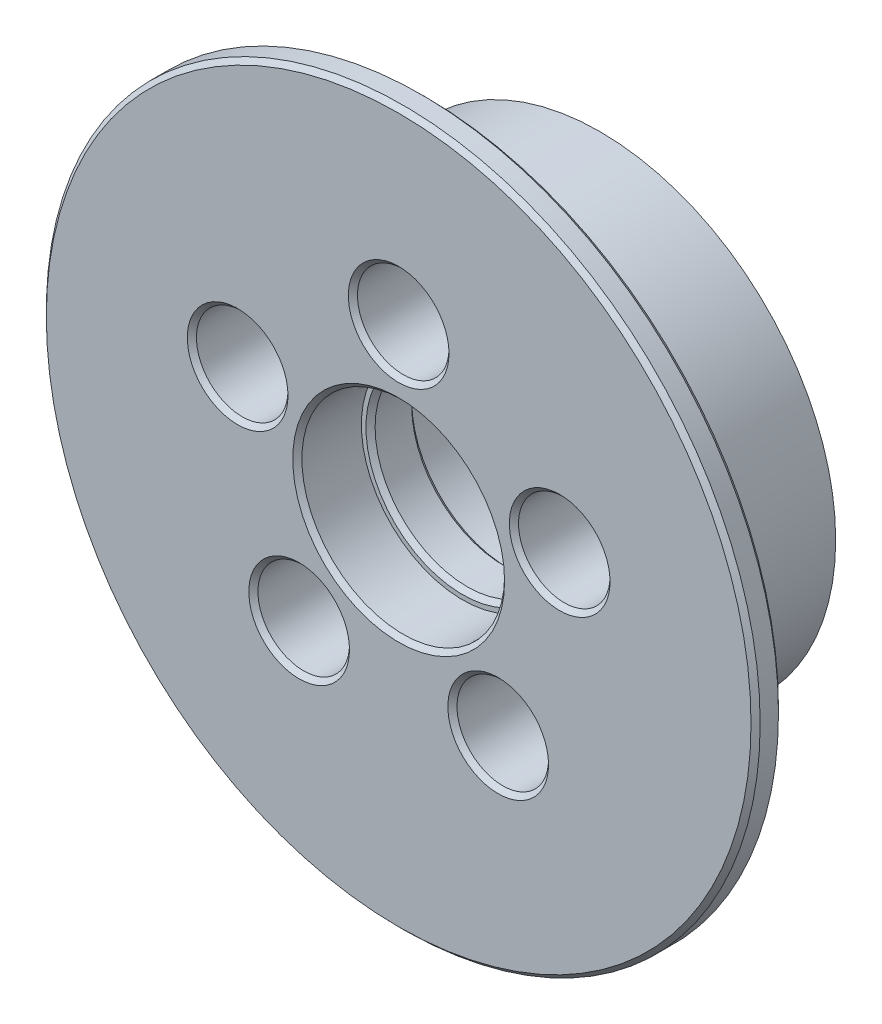
ISO-10303-21;
HEADER;
FILE_DESCRIPTION(('STEP AP214'),'2;1');
FILE_NAME('part.step','',(''),(''),'','','');
FILE_SCHEMA(('AUTOMOTIVE_DESIGN { 1 0 10303 214 1 1 1 1 }'));
ENDSEC;
DATA;
#1=APPLICATION_CONTEXT('core data for automotive mechanical design processes');
#2=APPLICATION_PROTOCOL_DEFINITION('international standard','automotive_design',2000,#1);
#3=PRODUCT_CONTEXT('',#1,'mechanical');
#4=PRODUCT('Part','Part','',(#3));
#5=PRODUCT_RELATED_PRODUCT_CATEGORY('part','',(#4));
#6=PRODUCT_DEFINITION_FORMATION('','',#4);
#7=PRODUCT_DEFINITION_CONTEXT('part definition',#1,'design');
#8=PRODUCT_DEFINITION('design','',#6,#7);
#9=PRODUCT_DEFINITION_SHAPE('','',#8);
#10=(LENGTH_UNIT() NAMED_UNIT(*) SI_UNIT(.MILLI.,.METRE.));
#11=(NAMED_UNIT(*) PLANE_ANGLE_UNIT() SI_UNIT($,.RADIAN.));
#12=(NAMED_UNIT(*) SI_UNIT($,.STERADIAN.) SOLID_ANGLE_UNIT());
#13=UNCERTAINTY_MEASURE_WITH_UNIT(LENGTH_MEASURE(1.E-05),#10,'distance_accuracy_value','');
#14=(GEOMETRIC_REPRESENTATION_CONTEXT(3) GLOBAL_UNCERTAINTY_ASSIGNED_CONTEXT((#13)) GLOBAL_UNIT_ASSIGNED_CONTEXT((#10,
#11,#12)) REPRESENTATION_CONTEXT('',''));
#15=CARTESIAN_POINT('',(0.,0.,0.));
#16=DIRECTION('',(0.,0.,1.));
#17=DIRECTION('',(1.,0.,0.));
#18=AXIS2_PLACEMENT_3D('',#15,#16,#17);
#19=CARTESIAN_POINT('',(0.,0.,22.));
#20=DIRECTION('',(0.,0.,-1.));
#21=DIRECTION('',(-1.,0.,0.));
#22=AXIS2_PLACEMENT_3D('',#19,#20,#21);
#23=CYLINDRICAL_SURFACE('',#22,10.075);
#24=CARTESIAN_POINT('',(0.,0.,10.5));
#25=DIRECTION('',(0.,0.,-1.));
#26=DIRECTION('',(-1.,0.,0.));
#27=AXIS2_PLACEMENT_3D('',#24,#25,#26);
#28=CIRCLE('',#27,10.075);
#29=CARTESIAN_POINT('',(-10.075,0.,10.5));
#30=VERTEX_POINT('',#29);
#31=EDGE_CURVE('E115',#30,#30,#28,.T.);
#32=ORIENTED_EDGE('',*,*,#31,.T.);
#33=EDGE_LOOP('',(#32));
#34=FACE_BOUND('',#33,.T.);
#35=CARTESIAN_POINT('',(0.,0.,14.5));
#36=DIRECTION('',(0.,0.,1.));
#37=DIRECTION('',(1.,0.,0.));
#38=AXIS2_PLACEMENT_3D('',#35,#36,#37);
#39=CIRCLE('',#38,10.075);
#40=CARTESIAN_POINT('',(10.075,0.,14.5));
#41=VERTEX_POINT('',#40);
#42=EDGE_CURVE('E119',#41,#41,#39,.T.);
#43=ORIENTED_EDGE('',*,*,#42,.T.);
#44=EDGE_LOOP('',(#43));
#45=FACE_BOUND('',#44,.T.);
#46=ADVANCED_FACE('F39',(#34,#45),#23,.F.);
#47=CARTESIAN_POINT('',(0.,0.,19.));
#48=DIRECTION('',(0.,0.,-1.));
#49=DIRECTION('',(-1.,0.,0.));
#50=AXIS2_PLACEMENT_3D('',#47,#48,#49);
#51=CYLINDRICAL_SURFACE('',#50,25.75);
#52=CARTESIAN_POINT('',(0.,0.,19.));
#53=DIRECTION('',(0.,0.,1.));
#54=DIRECTION('',(1.,0.,0.));
#55=AXIS2_PLACEMENT_3D('',#52,#53,#54);
#56=CIRCLE('',#55,25.75);
#57=CARTESIAN_POINT('',(25.75,0.,19.));
#58=VERTEX_POINT('',#57);
#59=EDGE_CURVE('E175',#58,#58,#56,.T.);
#60=ORIENTED_EDGE('',*,*,#59,.F.);
#61=EDGE_LOOP('',(#60));
#62=FACE_BOUND('',#61,.T.);
#63=CARTESIAN_POINT('',(0.,0.,0.));
#64=DIRECTION('',(0.,0.,1.));
#65=DIRECTION('',(1.,0.,0.));
#66=AXIS2_PLACEMENT_3D('',#63,#64,#65);
#67=CIRCLE('',#66,25.75);
#68=CARTESIAN_POINT('',(25.75,0.,0.));
#69=VERTEX_POINT('',#68);
#70=EDGE_CURVE('E176',#69,#69,#67,.T.);
#71=ORIENTED_EDGE('',*,*,#70,.T.);
#72=EDGE_LOOP('',(#71));
#73=FACE_BOUND('',#72,.T.);
#74=ADVANCED_FACE('F211',(#62,#73),#51,.T.);
#75=CARTESIAN_POINT('',(0.,0.,0.));
#76=DIRECTION('',(0.,0.,1.));
#77=DIRECTION('',(1.,0.,0.));
#78=AXIS2_PLACEMENT_3D('',#75,#76,#77);
#79=PLANE('',#78);
#80=CARTESIAN_POINT('',(0.,18.5,0.));
#81=DIRECTION('',(0.,0.,1.));
#82=DIRECTION('',(1.,0.,0.));
#83=AXIS2_PLACEMENT_3D('',#80,#81,#82);
#84=CIRCLE('',#83,6.);
#85=CARTESIAN_POINT('',(6.,18.5,0.));
#86=VERTEX_POINT('',#85);
#87=EDGE_CURVE('E63',#86,#86,#84,.T.);
#88=ORIENTED_EDGE('',*,*,#87,.T.);
#89=EDGE_LOOP('',(#88));
#90=FACE_BOUND('',#89,.T.);
#91=CARTESIAN_POINT('',(-17.5945455514603,5.71681439593653,0.));
#92=DIRECTION('',(0.,0.,1.));
#93=DIRECTION('',(1.,0.,0.));
#94=AXIS2_PLACEMENT_3D('',#91,#92,#93);
#95=CIRCLE('',#94,6.);
#96=CARTESIAN_POINT('',(-11.5945455514603,5.71681439593653,0.));
#97=VERTEX_POINT('',#96);
#98=EDGE_CURVE('E67',#97,#97,#95,.T.);
#99=ORIENTED_EDGE('',*,*,#98,.T.);
#100=EDGE_LOOP('',(#99));
#101=FACE_BOUND('',#100,.T.);
#102=CARTESIAN_POINT('',(-10.8740271674108,-14.9668143959365,0.));
#103=DIRECTION('',(0.,0.,1.));
#104=DIRECTION('',(1.,0.,0.));
#105=AXIS2_PLACEMENT_3D('',#102,#103,#104);
#106=CIRCLE('',#105,6.);
#107=CARTESIAN_POINT('',(-4.87402716741075,-14.9668143959365,0.));
#108=VERTEX_POINT('',#107);
#109=EDGE_CURVE('E71',#108,#108,#106,.T.);
#110=ORIENTED_EDGE('',*,*,#109,.T.);
#111=EDGE_LOOP('',(#110));
#112=FACE_BOUND('',#111,.T.);
#113=CARTESIAN_POINT('',(10.8740271674108,-14.9668143959365,0.));
#114=DIRECTION('',(0.,0.,1.));
#115=DIRECTION('',(1.,0.,0.));
#116=AXIS2_PLACEMENT_3D('',#113,#114,#115);
#117=CIRCLE('',#116,6.);
#118=CARTESIAN_POINT('',(16.8740271674108,-14.9668143959365,0.));
#119=VERTEX_POINT('',#118);
#120=EDGE_CURVE('E75',#119,#119,#117,.T.);
#121=ORIENTED_EDGE('',*,*,#120,.T.);
#122=EDGE_LOOP('',(#121));
#123=FACE_BOUND('',#122,.T.);
#124=CARTESIAN_POINT('',(17.5945455514603,5.71681439593652,0.));
#125=DIRECTION('',(0.,0.,1.));
#126=DIRECTION('',(1.,0.,0.));
#127=AXIS2_PLACEMENT_3D('',#124,#125,#126);
#128=CIRCLE('',#127,6.);
#129=CARTESIAN_POINT('',(23.5945455514603,5.71681439593652,0.));
#130=VERTEX_POINT('',#129);
#131=EDGE_CURVE('E79',#130,#130,#128,.T.);
#132=ORIENTED_EDGE('',*,*,#131,.T.);
#133=EDGE_LOOP('',(#132));
#134=FACE_BOUND('',#133,.T.);
#135=CARTESIAN_POINT('',(0.,0.,0.));
#136=DIRECTION('',(0.,0.,1.));
#137=DIRECTION('',(1.,0.,0.));
#138=AXIS2_PLACEMENT_3D('',#135,#136,#137);
#139=CIRCLE('',#138,11.575);
#140=CARTESIAN_POINT('',(11.575,0.,0.));
#141=VERTEX_POINT('',#140);
#142=EDGE_CURVE('E127',#141,#141,#139,.T.);
#143=ORIENTED_EDGE('',*,*,#142,.T.);
#144=EDGE_LOOP('',(#143));
#145=FACE_BOUND('',#144,.T.);
#146=ORIENTED_EDGE('',*,*,#70,.F.);
#147=EDGE_LOOP('',(#146));
#148=FACE_BOUND('',#147,.T.);
#149=ADVANCED_FACE('F217',(#90,#101,#112,#123,#134,#145,#148),#79,.F.);
#150=CARTESIAN_POINT('',(0.,0.,22.));
#151=DIRECTION('',(0.,0.,-1.));
#152=DIRECTION('',(-1.,0.,0.));
#153=AXIS2_PLACEMENT_3D('',#150,#151,#152);
#154=CYLINDRICAL_SURFACE('',#153,39.);
#155=CARTESIAN_POINT('',(0.,0.,21.5));
#156=DIRECTION('',(0.,0.,1.));
#157=DIRECTION('',(1.,0.,0.));
#158=AXIS2_PLACEMENT_3D('',#155,#156,#157);
#159=CIRCLE('',#158,39.);
#160=CARTESIAN_POINT('',(39.,0.,21.5));
#161=VERTEX_POINT('',#160);
#162=EDGE_CURVE('E139',#161,#161,#159,.F.);
#163=ORIENTED_EDGE('',*,*,#162,.T.);
#164=EDGE_LOOP('',(#163));
#165=FACE_BOUND('',#164,.T.);
#166=CARTESIAN_POINT('',(0.,0.,19.5));
#167=DIRECTION('',(0.,0.,1.));
#168=DIRECTION('',(1.,0.,0.));
#169=AXIS2_PLACEMENT_3D('',#166,#167,#168);
#170=CIRCLE('',#169,39.);
#171=CARTESIAN_POINT('',(39.,0.,19.5));
#172=VERTEX_POINT('',#171);
#173=EDGE_CURVE('E143',#172,#172,#170,.T.);
#174=ORIENTED_EDGE('',*,*,#173,.T.);
#175=EDGE_LOOP('',(#174));
#176=FACE_BOUND('',#175,.T.);
#177=ADVANCED_FACE('F246',(#165,#176),#154,.T.);
#178=CARTESIAN_POINT('',(0.,0.,22.));
#179=DIRECTION('',(0.,0.,1.));
#180=DIRECTION('',(1.,0.,0.));
#181=AXIS2_PLACEMENT_3D('',#178,#179,#180);
#182=PLANE('',#181);
#183=CARTESIAN_POINT('',(0.,0.,22.));
#184=DIRECTION('',(0.,0.,1.));
#185=DIRECTION('',(1.,0.,0.));
#186=AXIS2_PLACEMENT_3D('',#183,#184,#185);
#187=CIRCLE('',#186,38.5);
#188=CARTESIAN_POINT('',(38.5,0.,22.));
#189=VERTEX_POINT('',#188);
#190=EDGE_CURVE('E147',#189,#189,#187,.T.);
#191=ORIENTED_EDGE('',*,*,#190,.T.);
#192=EDGE_LOOP('',(#191));
#193=FACE_BOUND('',#192,.T.);
#194=CARTESIAN_POINT('',(0.,0.,22.));
#195=DIRECTION('',(0.,0.,1.));
#196=DIRECTION('',(1.,0.,0.));
#197=AXIS2_PLACEMENT_3D('',#194,#195,#196);
#198=CIRCLE('',#197,11.575);
#199=CARTESIAN_POINT('',(11.575,0.,22.));
#200=VERTEX_POINT('',#199);
#201=EDGE_CURVE('E151',#200,#200,#198,.F.);
#202=ORIENTED_EDGE('',*,*,#201,.T.);
#203=EDGE_LOOP('',(#202));
#204=FACE_BOUND('',#203,.T.);
#205=CARTESIAN_POINT('',(-10.8740271674108,-14.9668143959365,22.));
#206=DIRECTION('',(0.,0.,1.));
#207=DIRECTION('',(1.,0.,0.));
#208=AXIS2_PLACEMENT_3D('',#205,#206,#207);
#209=CIRCLE('',#208,5.50000000000001);
#210=CARTESIAN_POINT('',(-5.37402716741075,-14.9668143959365,22.));
#211=VERTEX_POINT('',#210);
#212=EDGE_CURVE('E155',#211,#211,#209,.F.);
#213=ORIENTED_EDGE('',*,*,#212,.T.);
#214=EDGE_LOOP('',(#213));
#215=FACE_BOUND('',#214,.T.);
#216=CARTESIAN_POINT('',(10.8740271674108,-14.9668143959365,22.));
#217=DIRECTION('',(0.,0.,1.));
#218=DIRECTION('',(1.,0.,0.));
#219=AXIS2_PLACEMENT_3D('',#216,#217,#218);
#220=CIRCLE('',#219,5.50000000000001);
#221=CARTESIAN_POINT('',(16.3740271674108,-14.9668143959365,22.));
#222=VERTEX_POINT('',#221);
#223=EDGE_CURVE('E159',#222,#222,#220,.F.);
#224=ORIENTED_EDGE('',*,*,#223,.T.);
#225=EDGE_LOOP('',(#224));
#226=FACE_BOUND('',#225,.T.);
#227=CARTESIAN_POINT('',(17.5945455514603,5.71681439593652,22.));
#228=DIRECTION('',(0.,0.,1.));
#229=DIRECTION('',(1.,0.,0.));
#230=AXIS2_PLACEMENT_3D('',#227,#228,#229);
#231=CIRCLE('',#230,5.50000000000001);
#232=CARTESIAN_POINT('',(23.0945455514603,5.71681439593652,22.));
#233=VERTEX_POINT('',#232);
#234=EDGE_CURVE('E163',#233,#233,#231,.F.);
#235=ORIENTED_EDGE('',*,*,#234,.T.);
#236=EDGE_LOOP('',(#235));
#237=FACE_BOUND('',#236,.T.);
#238=CARTESIAN_POINT('',(0.,18.5,22.));
#239=DIRECTION('',(0.,0.,1.));
#240=DIRECTION('',(1.,0.,0.));
#241=AXIS2_PLACEMENT_3D('',#238,#239,#240);
#242=CIRCLE('',#241,5.50000000000001);
#243=CARTESIAN_POINT('',(5.50000000000001,18.5,22.));
#244=VERTEX_POINT('',#243);
#245=EDGE_CURVE('E167',#244,#244,#242,.F.);
#246=ORIENTED_EDGE('',*,*,#245,.T.);
#247=EDGE_LOOP('',(#246));
#248=FACE_BOUND('',#247,.T.);
#249=CARTESIAN_POINT('',(-17.5945455514603,5.71681439593653,22.));
#250=DIRECTION('',(0.,0.,1.));
#251=DIRECTION('',(1.,0.,0.));
#252=AXIS2_PLACEMENT_3D('',#249,#250,#251);
#253=CIRCLE('',#252,5.50000000000001);
#254=CARTESIAN_POINT('',(-12.0945455514603,5.71681439593653,22.));
#255=VERTEX_POINT('',#254);
#256=EDGE_CURVE('E171',#255,#255,#253,.F.);
#257=ORIENTED_EDGE('',*,*,#256,.T.);
#258=EDGE_LOOP('',(#257));
#259=FACE_BOUND('',#258,.T.);
#260=ADVANCED_FACE('F243',(#193,#204,#215,#226,#237,#248,#259),#182,.T.);
#261=CARTESIAN_POINT('',(0.,0.,19.));
#262=DIRECTION('',(0.,0.,1.));
#263=DIRECTION('',(1.,0.,0.));
#264=AXIS2_PLACEMENT_3D('',#261,#262,#263);
#265=PLANE('',#264);
#266=CARTESIAN_POINT('',(0.,0.,19.));
#267=DIRECTION('',(0.,0.,1.));
#268=DIRECTION('',(1.,0.,0.));
#269=AXIS2_PLACEMENT_3D('',#266,#267,#268);
#270=CIRCLE('',#269,38.5);
#271=CARTESIAN_POINT('',(38.5,0.,19.));
#272=VERTEX_POINT('',#271);
#273=EDGE_CURVE('E135',#272,#272,#270,.F.);
#274=ORIENTED_EDGE('',*,*,#273,.T.);
#275=EDGE_LOOP('',(#274));
#276=FACE_BOUND('',#275,.T.);
#277=ORIENTED_EDGE('',*,*,#59,.T.);
#278=EDGE_LOOP('',(#277));
#279=FACE_BOUND('',#278,.T.);
#280=ADVANCED_FACE('F242',(#276,#279),#265,.F.);
#281=CARTESIAN_POINT('',(17.5945455514603,5.71681439593652,22.));
#282=DIRECTION('',(0.,0.,-1.));
#283=DIRECTION('',(-1.,0.,0.));
#284=AXIS2_PLACEMENT_3D('',#281,#282,#283);
#285=CYLINDRICAL_SURFACE('',#284,5.);
#286=CARTESIAN_POINT('',(17.5945455514603,5.71681439593652,1.));
#287=DIRECTION('',(0.,0.,1.));
#288=DIRECTION('',(1.,0.,0.));
#289=AXIS2_PLACEMENT_3D('',#286,#287,#288);
#290=CIRCLE('',#289,5.);
#291=CARTESIAN_POINT('',(22.5945455514603,5.71681439593652,1.));
#292=VERTEX_POINT('',#291);
#293=EDGE_CURVE('E10',#292,#292,#290,.F.);
#294=ORIENTED_EDGE('',*,*,#293,.T.);
#295=EDGE_LOOP('',(#294));
#296=FACE_BOUND('',#295,.T.);
#297=CARTESIAN_POINT('',(17.5945455514603,5.71681439593652,21.5));
#298=DIRECTION('',(0.,0.,1.));
#299=DIRECTION('',(1.,0.,0.));
#300=AXIS2_PLACEMENT_3D('',#297,#298,#299);
#301=CIRCLE('',#300,5.);
#302=CARTESIAN_POINT('',(22.5945455514603,5.71681439593652,21.5));
#303=VERTEX_POINT('',#302);
#304=EDGE_CURVE('E95',#303,#303,#301,.T.);
#305=ORIENTED_EDGE('',*,*,#304,.T.);
#306=EDGE_LOOP('',(#305));
#307=FACE_BOUND('',#306,.T.);
#308=ADVANCED_FACE('F239',(#296,#307),#285,.F.);
#309=CARTESIAN_POINT('',(10.8740271674108,-14.9668143959365,22.));
#310=DIRECTION('',(0.,0.,-1.));
#311=DIRECTION('',(-1.,0.,0.));
#312=AXIS2_PLACEMENT_3D('',#309,#310,#311);
#313=CYLINDRICAL_SURFACE('',#312,5.);
#314=CARTESIAN_POINT('',(10.8740271674108,-14.9668143959365,1.));
#315=DIRECTION('',(0.,0.,1.));
#316=DIRECTION('',(1.,0.,0.));
#317=AXIS2_PLACEMENT_3D('',#314,#315,#316);
#318=CIRCLE('',#317,5.);
#319=CARTESIAN_POINT('',(15.8740271674108,-14.9668143959365,1.));
#320=VERTEX_POINT('',#319);
#321=EDGE_CURVE('E47',#320,#320,#318,.F.);
#322=ORIENTED_EDGE('',*,*,#321,.T.);
#323=EDGE_LOOP('',(#322));
#324=FACE_BOUND('',#323,.T.);
#325=CARTESIAN_POINT('',(10.8740271674108,-14.9668143959365,21.5));
#326=DIRECTION('',(0.,0.,1.));
#327=DIRECTION('',(1.,0.,0.));
#328=AXIS2_PLACEMENT_3D('',#325,#326,#327);
#329=CIRCLE('',#328,5.);
#330=CARTESIAN_POINT('',(15.8740271674108,-14.9668143959365,21.5));
#331=VERTEX_POINT('',#330);
#332=EDGE_CURVE('E99',#331,#331,#329,.T.);
#333=ORIENTED_EDGE('',*,*,#332,.T.);
#334=EDGE_LOOP('',(#333));
#335=FACE_BOUND('',#334,.T.);
#336=ADVANCED_FACE('F235',(#324,#335),#313,.F.);
#337=CARTESIAN_POINT('',(-10.8740271674108,-14.9668143959365,22.));
#338=DIRECTION('',(0.,0.,-1.));
#339=DIRECTION('',(-1.,0.,0.));
#340=AXIS2_PLACEMENT_3D('',#337,#338,#339);
#341=CYLINDRICAL_SURFACE('',#340,5.);
#342=CARTESIAN_POINT('',(-10.8740271674108,-14.9668143959365,1.));
#343=DIRECTION('',(0.,0.,1.));
#344=DIRECTION('',(1.,0.,0.));
#345=AXIS2_PLACEMENT_3D('',#342,#343,#344);
#346=CIRCLE('',#345,5.);
#347=CARTESIAN_POINT('',(-5.87402716741075,-14.9668143959365,1.));
#348=VERTEX_POINT('',#347);
#349=EDGE_CURVE('E52',#348,#348,#346,.F.);
#350=ORIENTED_EDGE('',*,*,#349,.T.);
#351=EDGE_LOOP('',(#350));
#352=FACE_BOUND('',#351,.T.);
#353=CARTESIAN_POINT('',(-10.8740271674108,-14.9668143959365,21.5));
#354=DIRECTION('',(0.,0.,1.));
#355=DIRECTION('',(1.,0.,0.));
#356=AXIS2_PLACEMENT_3D('',#353,#354,#355);
#357=CIRCLE('',#356,5.);
#358=CARTESIAN_POINT('',(-5.87402716741075,-14.9668143959365,21.5));
#359=VERTEX_POINT('',#358);
#360=EDGE_CURVE('E103',#359,#359,#357,.T.);
#361=ORIENTED_EDGE('',*,*,#360,.T.);
#362=EDGE_LOOP('',(#361));
#363=FACE_BOUND('',#362,.T.);
#364=ADVANCED_FACE('F231',(#352,#363),#341,.F.);
#365=CARTESIAN_POINT('',(-17.5945455514603,5.71681439593653,22.));
#366=DIRECTION('',(0.,0.,-1.));
#367=DIRECTION('',(-1.,0.,0.));
#368=AXIS2_PLACEMENT_3D('',#365,#366,#367);
#369=CYLINDRICAL_SURFACE('',#368,5.);
#370=CARTESIAN_POINT('',(-17.5945455514603,5.71681439593653,1.));
#371=DIRECTION('',(0.,0.,1.));
#372=DIRECTION('',(1.,0.,0.));
#373=AXIS2_PLACEMENT_3D('',#370,#371,#372);
#374=CIRCLE('',#373,5.);
#375=CARTESIAN_POINT('',(-12.5945455514603,5.71681439593653,1.));
#376=VERTEX_POINT('',#375);
#377=EDGE_CURVE('E57',#376,#376,#374,.F.);
#378=ORIENTED_EDGE('',*,*,#377,.T.);
#379=EDGE_LOOP('',(#378));
#380=FACE_BOUND('',#379,.T.);
#381=CARTESIAN_POINT('',(-17.5945455514603,5.71681439593653,21.5));
#382=DIRECTION('',(0.,0.,1.));
#383=DIRECTION('',(1.,0.,0.));
#384=AXIS2_PLACEMENT_3D('',#381,#382,#383);
#385=CIRCLE('',#384,5.);
#386=CARTESIAN_POINT('',(-12.5945455514603,5.71681439593653,21.5));
#387=VERTEX_POINT('',#386);
#388=EDGE_CURVE('E87',#387,#387,#385,.T.);
#389=ORIENTED_EDGE('',*,*,#388,.T.);
#390=EDGE_LOOP('',(#389));
#391=FACE_BOUND('',#390,.T.);
#392=ADVANCED_FACE('F227',(#380,#391),#369,.F.);
#393=CARTESIAN_POINT('',(0.,18.5,22.));
#394=DIRECTION('',(0.,0.,-1.));
#395=DIRECTION('',(-1.,0.,0.));
#396=AXIS2_PLACEMENT_3D('',#393,#394,#395);
#397=CYLINDRICAL_SURFACE('',#396,5.);
#398=CARTESIAN_POINT('',(0.,18.5,1.));
#399=DIRECTION('',(0.,0.,1.));
#400=DIRECTION('',(1.,0.,0.));
#401=AXIS2_PLACEMENT_3D('',#398,#399,#400);
#402=CIRCLE('',#401,5.);
#403=CARTESIAN_POINT('',(5.,18.5,1.));
#404=VERTEX_POINT('',#403);
#405=EDGE_CURVE('E83',#404,#404,#402,.F.);
#406=ORIENTED_EDGE('',*,*,#405,.T.);
#407=EDGE_LOOP('',(#406));
#408=FACE_BOUND('',#407,.T.);
#409=CARTESIAN_POINT('',(0.,18.5,21.5));
#410=DIRECTION('',(0.,0.,1.));
#411=DIRECTION('',(1.,0.,0.));
#412=AXIS2_PLACEMENT_3D('',#409,#410,#411);
#413=CIRCLE('',#412,5.);
#414=CARTESIAN_POINT('',(5.,18.5,21.5));
#415=VERTEX_POINT('',#414);
#416=EDGE_CURVE('E91',#415,#415,#413,.T.);
#417=ORIENTED_EDGE('',*,*,#416,.T.);
#418=EDGE_LOOP('',(#417));
#419=FACE_BOUND('',#418,.T.);
#420=ADVANCED_FACE('F223',(#408,#419),#397,.F.);
#421=CARTESIAN_POINT('',(0.,0.,10.));
#422=DIRECTION('',(0.,0.,-1.));
#423=DIRECTION('',(-1.,0.,0.));
#424=AXIS2_PLACEMENT_3D('',#421,#422,#423);
#425=PLANE('',#424);
#426=CARTESIAN_POINT('',(0.,0.,10.));
#427=DIRECTION('',(0.,0.,-1.));
#428=DIRECTION('',(-1.,0.,0.));
#429=AXIS2_PLACEMENT_3D('',#426,#427,#428);
#430=CIRCLE('',#429,10.575);
#431=CARTESIAN_POINT('',(-10.575,0.,10.));
#432=VERTEX_POINT('',#431);
#433=EDGE_CURVE('E123',#432,#432,#430,.F.);
#434=ORIENTED_EDGE('',*,*,#433,.T.);
#435=EDGE_LOOP('',(#434));
#436=FACE_BOUND('',#435,.T.);
#437=CARTESIAN_POINT('',(0.,0.,10.));
#438=DIRECTION('',(0.,0.,-1.));
#439=DIRECTION('',(-1.,0.,0.));
#440=AXIS2_PLACEMENT_3D('',#437,#438,#439);
#441=CIRCLE('',#440,11.075);
#442=CARTESIAN_POINT('',(-11.075,0.,10.));
#443=VERTEX_POINT('',#442);
#444=EDGE_CURVE('E180',#443,#443,#441,.T.);
#445=ORIENTED_EDGE('',*,*,#444,.T.);
#446=EDGE_LOOP('',(#445));
#447=FACE_BOUND('',#446,.T.);
#448=ADVANCED_FACE('F226',(#436,#447),#425,.T.);
#449=CARTESIAN_POINT('',(0.,0.,10.));
#450=DIRECTION('',(0.,0.,-1.));
#451=DIRECTION('',(-1.,0.,0.));
#452=AXIS2_PLACEMENT_3D('',#449,#450,#451);
#453=CYLINDRICAL_SURFACE('',#452,11.075);
#454=CARTESIAN_POINT('',(0.,0.,0.499999999999987));
#455=DIRECTION('',(0.,0.,1.));
#456=DIRECTION('',(1.,0.,0.));
#457=AXIS2_PLACEMENT_3D('',#454,#455,#456);
#458=CIRCLE('',#457,11.075);
#459=CARTESIAN_POINT('',(11.075,0.,0.499999999999987));
#460=VERTEX_POINT('',#459);
#461=EDGE_CURVE('E131',#460,#460,#458,.F.);
#462=ORIENTED_EDGE('',*,*,#461,.T.);
#463=EDGE_LOOP('',(#462));
#464=FACE_BOUND('',#463,.T.);
#465=ORIENTED_EDGE('',*,*,#444,.F.);
#466=EDGE_LOOP('',(#465));
#467=FACE_BOUND('',#466,.T.);
#468=ADVANCED_FACE('F206',(#464,#467),#453,.F.);
#469=CARTESIAN_POINT('',(0.,0.,15.));
#470=DIRECTION('',(0.,0.,1.));
#471=DIRECTION('',(1.,0.,0.));
#472=AXIS2_PLACEMENT_3D('',#469,#470,#471);
#473=PLANE('',#472);
#474=CARTESIAN_POINT('',(0.,0.,15.));
#475=DIRECTION('',(0.,0.,1.));
#476=DIRECTION('',(1.,0.,0.));
#477=AXIS2_PLACEMENT_3D('',#474,#475,#476);
#478=CIRCLE('',#477,10.575);
#479=CARTESIAN_POINT('',(10.575,0.,15.));
#480=VERTEX_POINT('',#479);
#481=EDGE_CURVE('E111',#480,#480,#478,.F.);
#482=ORIENTED_EDGE('',*,*,#481,.T.);
#483=EDGE_LOOP('',(#482));
#484=FACE_BOUND('',#483,.T.);
#485=CARTESIAN_POINT('',(0.,0.,15.));
#486=DIRECTION('',(0.,0.,1.));
#487=DIRECTION('',(1.,0.,0.));
#488=AXIS2_PLACEMENT_3D('',#485,#486,#487);
#489=CIRCLE('',#488,11.075);
#490=CARTESIAN_POINT('',(11.075,0.,15.));
#491=VERTEX_POINT('',#490);
#492=EDGE_CURVE('E187',#491,#491,#489,.T.);
#493=ORIENTED_EDGE('',*,*,#492,.T.);
#494=EDGE_LOOP('',(#493));
#495=FACE_BOUND('',#494,.T.);
#496=ADVANCED_FACE('F192',(#484,#495),#473,.T.);
#497=CARTESIAN_POINT('',(0.,0.,15.));
#498=DIRECTION('',(0.,0.,1.));
#499=DIRECTION('',(1.,0.,0.));
#500=AXIS2_PLACEMENT_3D('',#497,#498,#499);
#501=CYLINDRICAL_SURFACE('',#500,11.075);
#502=CARTESIAN_POINT('',(0.,0.,21.5));
#503=DIRECTION('',(0.,0.,1.));
#504=DIRECTION('',(1.,0.,0.));
#505=AXIS2_PLACEMENT_3D('',#502,#503,#504);
#506=CIRCLE('',#505,11.075);
#507=CARTESIAN_POINT('',(11.075,0.,21.5));
#508=VERTEX_POINT('',#507);
#509=EDGE_CURVE('E107',#508,#508,#506,.T.);
#510=ORIENTED_EDGE('',*,*,#509,.T.);
#511=EDGE_LOOP('',(#510));
#512=FACE_BOUND('',#511,.T.);
#513=ORIENTED_EDGE('',*,*,#492,.F.);
#514=EDGE_LOOP('',(#513));
#515=FACE_BOUND('',#514,.T.);
#516=ADVANCED_FACE('F194',(#512,#515),#501,.F.);
#517=CARTESIAN_POINT('',(0.,0.,22.));
#518=DIRECTION('',(0.,0.,-1.));
#519=DIRECTION('',(-1.,0.,0.));
#520=AXIS2_PLACEMENT_3D('',#517,#518,#519);
#521=CONICAL_SURFACE('',#520,38.5,0.785398163397441);
#522=ORIENTED_EDGE('',*,*,#162,.F.);
#523=EDGE_LOOP('',(#522));
#524=FACE_BOUND('',#523,.T.);
#525=ORIENTED_EDGE('',*,*,#190,.F.);
#526=EDGE_LOOP('',(#525));
#527=FACE_BOUND('',#526,.T.);
#528=ADVANCED_FACE('F196',(#524,#527),#521,.T.);
#529=CARTESIAN_POINT('',(0.,0.,19.5));
#530=DIRECTION('',(0.,0.,1.));
#531=DIRECTION('',(1.,0.,0.));
#532=AXIS2_PLACEMENT_3D('',#529,#530,#531);
#533=CONICAL_SURFACE('',#532,39.,0.785398163397455);
#534=ORIENTED_EDGE('',*,*,#273,.F.);
#535=EDGE_LOOP('',(#534));
#536=FACE_BOUND('',#535,.T.);
#537=ORIENTED_EDGE('',*,*,#173,.F.);
#538=EDGE_LOOP('',(#537));
#539=FACE_BOUND('',#538,.T.);
#540=ADVANCED_FACE('F203',(#536,#539),#533,.T.);
#541=CARTESIAN_POINT('',(0.,0.,0.499999999999987));
#542=DIRECTION('',(0.,0.,-1.));
#543=DIRECTION('',(-1.,0.,0.));
#544=AXIS2_PLACEMENT_3D('',#541,#542,#543);
#545=CONICAL_SURFACE('',#544,11.075,0.785398163397452);
#546=ORIENTED_EDGE('',*,*,#142,.F.);
#547=EDGE_LOOP('',(#546));
#548=FACE_BOUND('',#547,.T.);
#549=ORIENTED_EDGE('',*,*,#461,.F.);
#550=EDGE_LOOP('',(#549));
#551=FACE_BOUND('',#550,.T.);
#552=ADVANCED_FACE('F259',(#548,#551),#545,.F.);
#553=CARTESIAN_POINT('',(0.,0.,10.));
#554=DIRECTION('',(0.,0.,-1.));
#555=DIRECTION('',(-1.,0.,0.));
#556=AXIS2_PLACEMENT_3D('',#553,#554,#555);
#557=CONICAL_SURFACE('',#556,10.575,0.785398163397441);
#558=ORIENTED_EDGE('',*,*,#31,.F.);
#559=EDGE_LOOP('',(#558));
#560=FACE_BOUND('',#559,.T.);
#561=ORIENTED_EDGE('',*,*,#433,.F.);
#562=EDGE_LOOP('',(#561));
#563=FACE_BOUND('',#562,.T.);
#564=ADVANCED_FACE('F263',(#560,#563),#557,.F.);
#565=CARTESIAN_POINT('',(0.,0.,15.));
#566=DIRECTION('',(0.,0.,1.));
#567=DIRECTION('',(1.,0.,0.));
#568=AXIS2_PLACEMENT_3D('',#565,#566,#567);
#569=CONICAL_SURFACE('',#568,10.575,0.785398163397441);
#570=ORIENTED_EDGE('',*,*,#42,.F.);
#571=EDGE_LOOP('',(#570));
#572=FACE_BOUND('',#571,.T.);
#573=ORIENTED_EDGE('',*,*,#481,.F.);
#574=EDGE_LOOP('',(#573));
#575=FACE_BOUND('',#574,.T.);
#576=ADVANCED_FACE('F267',(#572,#575),#569,.F.);
#577=CARTESIAN_POINT('',(0.,0.,21.5));
#578=DIRECTION('',(0.,0.,1.));
#579=DIRECTION('',(1.,0.,0.));
#580=AXIS2_PLACEMENT_3D('',#577,#578,#579);
#581=CONICAL_SURFACE('',#580,11.075,0.785398163397459);
#582=ORIENTED_EDGE('',*,*,#201,.F.);
#583=EDGE_LOOP('',(#582));
#584=FACE_BOUND('',#583,.T.);
#585=ORIENTED_EDGE('',*,*,#509,.F.);
#586=EDGE_LOOP('',(#585));
#587=FACE_BOUND('',#586,.T.);
#588=ADVANCED_FACE('F271',(#584,#587),#581,.F.);
#589=CARTESIAN_POINT('',(-10.8740271674108,-14.9668143959365,22.));
#590=DIRECTION('',(0.,0.,1.));
#591=DIRECTION('',(1.,0.,0.));
#592=AXIS2_PLACEMENT_3D('',#589,#590,#591);
#593=CONICAL_SURFACE('',#592,5.50000000000001,0.78539816339745);
#594=ORIENTED_EDGE('',*,*,#360,.F.);
#595=EDGE_LOOP('',(#594));
#596=FACE_BOUND('',#595,.T.);
#597=ORIENTED_EDGE('',*,*,#212,.F.);
#598=EDGE_LOOP('',(#597));
#599=FACE_BOUND('',#598,.T.);
#600=ADVANCED_FACE('F275',(#596,#599),#593,.F.);
#601=CARTESIAN_POINT('',(10.8740271674108,-14.9668143959365,22.));
#602=DIRECTION('',(0.,0.,1.));
#603=DIRECTION('',(1.,0.,0.));
#604=AXIS2_PLACEMENT_3D('',#601,#602,#603);
#605=CONICAL_SURFACE('',#604,5.50000000000001,0.785398163397428);
#606=ORIENTED_EDGE('',*,*,#332,.F.);
#607=EDGE_LOOP('',(#606));
#608=FACE_BOUND('',#607,.T.);
#609=ORIENTED_EDGE('',*,*,#223,.F.);
#610=EDGE_LOOP('',(#609));
#611=FACE_BOUND('',#610,.T.);
#612=ADVANCED_FACE('F279',(#608,#611),#605,.F.);
#613=CARTESIAN_POINT('',(17.5945455514603,5.71681439593652,22.));
#614=DIRECTION('',(0.,0.,1.));
#615=DIRECTION('',(1.,0.,0.));
#616=AXIS2_PLACEMENT_3D('',#613,#614,#615);
#617=CONICAL_SURFACE('',#616,5.50000000000001,0.785398163397431);
#618=ORIENTED_EDGE('',*,*,#304,.F.);
#619=EDGE_LOOP('',(#618));
#620=FACE_BOUND('',#619,.T.);
#621=ORIENTED_EDGE('',*,*,#234,.F.);
#622=EDGE_LOOP('',(#621));
#623=FACE_BOUND('',#622,.T.);
#624=ADVANCED_FACE('F283',(#620,#623),#617,.F.);
#625=CARTESIAN_POINT('',(0.,18.5,22.));
#626=DIRECTION('',(0.,0.,1.));
#627=DIRECTION('',(1.,0.,0.));
#628=AXIS2_PLACEMENT_3D('',#625,#626,#627);
#629=CONICAL_SURFACE('',#628,5.50000000000001,0.785398163397453);
#630=ORIENTED_EDGE('',*,*,#416,.F.);
#631=EDGE_LOOP('',(#630));
#632=FACE_BOUND('',#631,.T.);
#633=ORIENTED_EDGE('',*,*,#245,.F.);
#634=EDGE_LOOP('',(#633));
#635=FACE_BOUND('',#634,.T.);
#636=ADVANCED_FACE('F287',(#632,#635),#629,.F.);
#637=CARTESIAN_POINT('',(-17.5945455514603,5.71681439593653,22.));
#638=DIRECTION('',(0.,0.,1.));
#639=DIRECTION('',(1.,0.,0.));
#640=AXIS2_PLACEMENT_3D('',#637,#638,#639);
#641=CONICAL_SURFACE('',#640,5.50000000000001,0.785398163397452);
#642=ORIENTED_EDGE('',*,*,#388,.F.);
#643=EDGE_LOOP('',(#642));
#644=FACE_BOUND('',#643,.T.);
#645=ORIENTED_EDGE('',*,*,#256,.F.);
#646=EDGE_LOOP('',(#645));
#647=FACE_BOUND('',#646,.T.);
#648=ADVANCED_FACE('F291',(#644,#647),#641,.F.);
#649=CARTESIAN_POINT('',(0.,18.5,1.));
#650=DIRECTION('',(0.,0.,1.));
#651=DIRECTION('',(1.,0.,0.));
#652=AXIS2_PLACEMENT_3D('',#649,#650,#651);
#653=TOROIDAL_SURFACE('',#652,6.,1.);
#654=ORIENTED_EDGE('',*,*,#87,.F.);
#655=EDGE_LOOP('',(#654));
#656=FACE_BOUND('',#655,.T.);
#657=ORIENTED_EDGE('',*,*,#405,.F.);
#658=EDGE_LOOP('',(#657));
#659=FACE_BOUND('',#658,.T.);
#660=ADVANCED_FACE('F295',(#656,#659),#653,.T.);
#661=CARTESIAN_POINT('',(-17.5945455514603,5.71681439593653,1.));
#662=DIRECTION('',(0.,0.,1.));
#663=DIRECTION('',(1.,0.,0.));
#664=AXIS2_PLACEMENT_3D('',#661,#662,#663);
#665=TOROIDAL_SURFACE('',#664,6.,1.);
#666=ORIENTED_EDGE('',*,*,#98,.F.);
#667=EDGE_LOOP('',(#666));
#668=FACE_BOUND('',#667,.T.);
#669=ORIENTED_EDGE('',*,*,#377,.F.);
#670=EDGE_LOOP('',(#669));
#671=FACE_BOUND('',#670,.T.);
#672=ADVANCED_FACE('F299',(#668,#671),#665,.T.);
#673=CARTESIAN_POINT('',(-10.8740271674108,-14.9668143959365,1.));
#674=DIRECTION('',(0.,0.,1.));
#675=DIRECTION('',(1.,0.,0.));
#676=AXIS2_PLACEMENT_3D('',#673,#674,#675);
#677=TOROIDAL_SURFACE('',#676,6.,1.);
#678=ORIENTED_EDGE('',*,*,#109,.F.);
#679=EDGE_LOOP('',(#678));
#680=FACE_BOUND('',#679,.T.);
#681=ORIENTED_EDGE('',*,*,#349,.F.);
#682=EDGE_LOOP('',(#681));
#683=FACE_BOUND('',#682,.T.);
#684=ADVANCED_FACE('F303',(#680,#683),#677,.T.);
#685=CARTESIAN_POINT('',(10.8740271674108,-14.9668143959365,1.));
#686=DIRECTION('',(0.,0.,1.));
#687=DIRECTION('',(1.,0.,0.));
#688=AXIS2_PLACEMENT_3D('',#685,#686,#687);
#689=TOROIDAL_SURFACE('',#688,6.,1.);
#690=ORIENTED_EDGE('',*,*,#120,.F.);
#691=EDGE_LOOP('',(#690));
#692=FACE_BOUND('',#691,.T.);
#693=ORIENTED_EDGE('',*,*,#321,.F.);
#694=EDGE_LOOP('',(#693));
#695=FACE_BOUND('',#694,.T.);
#696=ADVANCED_FACE('F306',(#692,#695),#689,.T.);
#697=CARTESIAN_POINT('',(17.5945455514603,5.71681439593652,1.));
#698=DIRECTION('',(0.,0.,1.));
#699=DIRECTION('',(1.,0.,0.));
#700=AXIS2_PLACEMENT_3D('',#697,#698,#699);
#701=TOROIDAL_SURFACE('',#700,6.,1.);
#702=ORIENTED_EDGE('',*,*,#131,.F.);
#703=EDGE_LOOP('',(#702));
#704=FACE_BOUND('',#703,.T.);
#705=ORIENTED_EDGE('',*,*,#293,.F.);
#706=EDGE_LOOP('',(#705));
#707=FACE_BOUND('',#706,.T.);
#708=ADVANCED_FACE('F41',(#704,#707),#701,.T.);
#709=CLOSED_SHELL('',(#46,#74,#149,#177,#260,#280,#308,#336,#364,#392,#420,#448,#468,#496,#516,
#528,#540,#552,#564,#576,#588,#600,#612,#624,#636,#648,#660,#672,#684,#696,#708));
#710=MANIFOLD_SOLID_BREP('B2',#709);
#711=ADVANCED_BREP_SHAPE_REPRESENTATION('',(#18,#710),#14);
#712=SHAPE_DEFINITION_REPRESENTATION(#9,#711);
ENDSEC;
END-ISO-10303-21;
